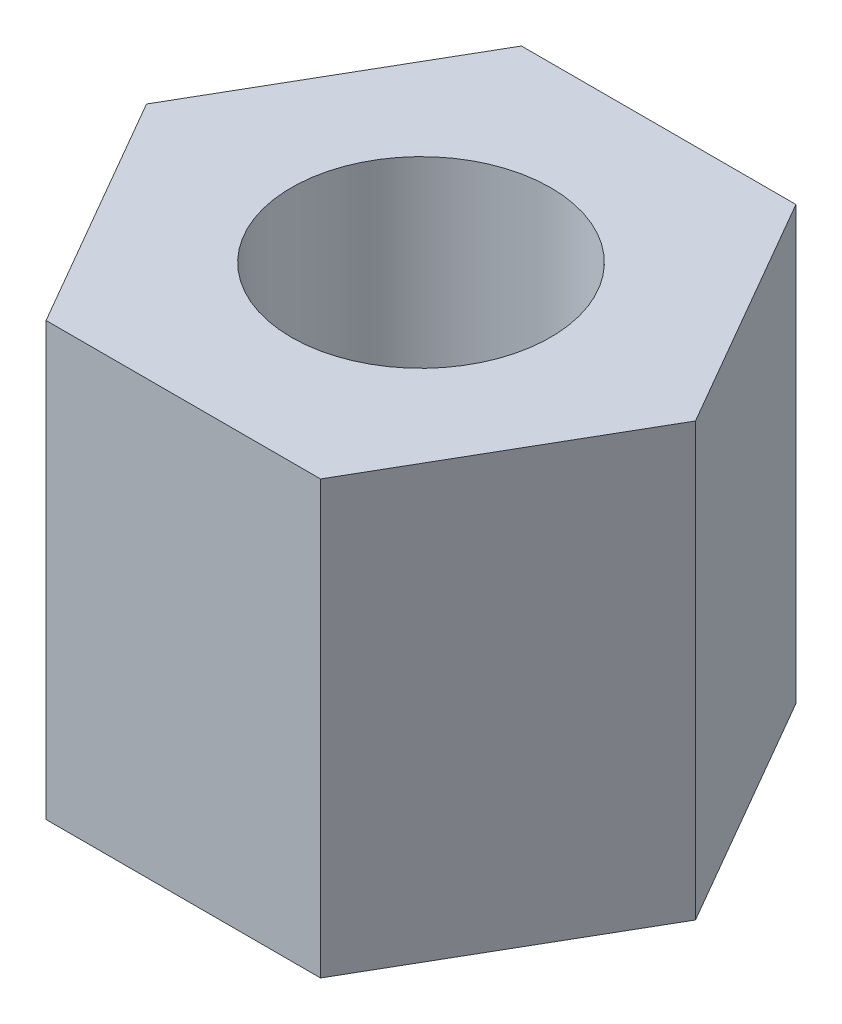
ISO-10303-21;
HEADER;
FILE_DESCRIPTION(('STEP AP214'),'2;1');
FILE_NAME('part.step','',(''),(''),'','','');
FILE_SCHEMA(('AUTOMOTIVE_DESIGN { 1 0 10303 214 1 1 1 1 }'));
ENDSEC;
DATA;
#1=APPLICATION_CONTEXT('core data for automotive mechanical design processes');
#2=APPLICATION_PROTOCOL_DEFINITION('international standard','automotive_design',2000,#1);
#3=PRODUCT_CONTEXT('',#1,'mechanical');
#4=PRODUCT('Part','Part','',(#3));
#5=PRODUCT_RELATED_PRODUCT_CATEGORY('part','',(#4));
#6=PRODUCT_DEFINITION_FORMATION('','',#4);
#7=PRODUCT_DEFINITION_CONTEXT('part definition',#1,'design');
#8=PRODUCT_DEFINITION('design','',#6,#7);
#9=PRODUCT_DEFINITION_SHAPE('','',#8);
#10=(LENGTH_UNIT() NAMED_UNIT(*) SI_UNIT(.MILLI.,.METRE.));
#11=(NAMED_UNIT(*) PLANE_ANGLE_UNIT() SI_UNIT($,.RADIAN.));
#12=(NAMED_UNIT(*) SI_UNIT($,.STERADIAN.) SOLID_ANGLE_UNIT());
#13=UNCERTAINTY_MEASURE_WITH_UNIT(LENGTH_MEASURE(1.E-05),#10,'distance_accuracy_value','');
#14=(GEOMETRIC_REPRESENTATION_CONTEXT(3) GLOBAL_UNCERTAINTY_ASSIGNED_CONTEXT((#13)) GLOBAL_UNIT_ASSIGNED_CONTEXT((#10,
#11,#12)) REPRESENTATION_CONTEXT('',''));
#15=CARTESIAN_POINT('',(0.,0.,0.));
#16=DIRECTION('',(0.,0.,1.));
#17=DIRECTION('',(1.,0.,0.));
#18=AXIS2_PLACEMENT_3D('',#15,#16,#17);
#19=CARTESIAN_POINT('',(0.,5.,0.));
#20=DIRECTION('',(0.,1.,0.));
#21=DIRECTION('',(0.,0.,1.));
#22=AXIS2_PLACEMENT_3D('',#19,#20,#21);
#23=PLANE('',#22);
#24=DIRECTION('',(0.499999999999995,0.,-0.866025403784442));
#25=VECTOR('',#24,1.);
#26=CARTESIAN_POINT('',(1.58771324027149,5.,2.74999999999997));
#27=LINE('',#26,#25);
#28=CARTESIAN_POINT('',(1.58771324027149,5.,2.74999999999997));
#29=VERTEX_POINT('',#28);
#30=CARTESIAN_POINT('',(3.17542648054293,5.,0.));
#31=VERTEX_POINT('',#30);
#32=EDGE_CURVE('E152',#29,#31,#27,.T.);
#33=ORIENTED_EDGE('',*,*,#32,.T.);
#34=DIRECTION('',(-0.500000000000001,0.,-0.866025403784438));
#35=VECTOR('',#34,1.);
#36=CARTESIAN_POINT('',(3.17542648054293,5.,0.));
#37=LINE('',#36,#35);
#38=CARTESIAN_POINT('',(1.58771324027146,5.,-2.74999999999999));
#39=VERTEX_POINT('',#38);
#40=EDGE_CURVE('E100',#31,#39,#37,.T.);
#41=ORIENTED_EDGE('',*,*,#40,.T.);
#42=DIRECTION('',(-1.,0.,0.));
#43=VECTOR('',#42,1.);
#44=CARTESIAN_POINT('',(1.58771324027146,5.,-2.74999999999999));
#45=LINE('',#44,#43);
#46=CARTESIAN_POINT('',(-1.58771324027148,5.,-2.74999999999998));
#47=VERTEX_POINT('',#46);
#48=EDGE_CURVE('E113',#39,#47,#45,.T.);
#49=ORIENTED_EDGE('',*,*,#48,.T.);
#50=DIRECTION('',(-0.499999999999995,0.,0.866025403784442));
#51=VECTOR('',#50,1.);
#52=CARTESIAN_POINT('',(-1.58771324027148,5.,-2.74999999999998));
#53=LINE('',#52,#51);
#54=CARTESIAN_POINT('',(-3.17542648054293,5.,0.));
#55=VERTEX_POINT('',#54);
#56=EDGE_CURVE('E107',#47,#55,#53,.T.);
#57=ORIENTED_EDGE('',*,*,#56,.T.);
#58=DIRECTION('',(0.500000000000007,0.,0.866025403784435));
#59=VECTOR('',#58,1.);
#60=CARTESIAN_POINT('',(-3.17542648054293,5.,0.));
#61=LINE('',#60,#59);
#62=CARTESIAN_POINT('',(-1.58771324027144,5.,2.75));
#63=VERTEX_POINT('',#62);
#64=EDGE_CURVE('E111',#55,#63,#61,.T.);
#65=ORIENTED_EDGE('',*,*,#64,.T.);
#66=DIRECTION('',(1.,0.,0.));
#67=VECTOR('',#66,1.);
#68=CARTESIAN_POINT('',(-1.58771324027144,5.,2.75));
#69=LINE('',#68,#67);
#70=EDGE_CURVE('E63',#63,#29,#69,.T.);
#71=ORIENTED_EDGE('',*,*,#70,.T.);
#72=EDGE_LOOP('',(#33,#41,#49,#57,#65,#71));
#73=FACE_BOUND('',#72,.T.);
#74=CARTESIAN_POINT('',(0.,5.,0.));
#75=DIRECTION('',(0.,1.,0.));
#76=DIRECTION('',(0.,0.,1.));
#77=AXIS2_PLACEMENT_3D('',#74,#75,#76);
#78=CIRCLE('',#77,1.5);
#79=CARTESIAN_POINT('',(0.,5.,1.5));
#80=VERTEX_POINT('',#79);
#81=EDGE_CURVE('E140',#80,#80,#78,.T.);
#82=ORIENTED_EDGE('',*,*,#81,.F.);
#83=EDGE_LOOP('',(#82));
#84=FACE_BOUND('',#83,.T.);
#85=ADVANCED_FACE('F45',(#73,#84),#23,.T.);
#86=CARTESIAN_POINT('',(0.,0.,0.));
#87=DIRECTION('',(0.,1.,0.));
#88=DIRECTION('',(0.,0.,1.));
#89=AXIS2_PLACEMENT_3D('',#86,#87,#88);
#90=PLANE('',#89);
#91=DIRECTION('',(0.499999999999995,0.,-0.866025403784442));
#92=VECTOR('',#91,1.);
#93=CARTESIAN_POINT('',(1.58771324027149,0.,2.74999999999997));
#94=LINE('',#93,#92);
#95=CARTESIAN_POINT('',(1.58771324027149,0.,2.74999999999997));
#96=VERTEX_POINT('',#95);
#97=CARTESIAN_POINT('',(3.17542648054293,0.,0.));
#98=VERTEX_POINT('',#97);
#99=EDGE_CURVE('E135',#96,#98,#94,.T.);
#100=ORIENTED_EDGE('',*,*,#99,.F.);
#101=DIRECTION('',(1.,0.,0.));
#102=VECTOR('',#101,1.);
#103=CARTESIAN_POINT('',(-1.58771324027144,0.,2.75));
#104=LINE('',#103,#102);
#105=CARTESIAN_POINT('',(-1.58771324027144,0.,2.75));
#106=VERTEX_POINT('',#105);
#107=EDGE_CURVE('E92',#106,#96,#104,.T.);
#108=ORIENTED_EDGE('',*,*,#107,.F.);
#109=DIRECTION('',(0.500000000000007,0.,0.866025403784435));
#110=VECTOR('',#109,1.);
#111=CARTESIAN_POINT('',(-3.17542648054293,0.,0.));
#112=LINE('',#111,#110);
#113=CARTESIAN_POINT('',(-3.17542648054293,0.,0.));
#114=VERTEX_POINT('',#113);
#115=EDGE_CURVE('E86',#114,#106,#112,.T.);
#116=ORIENTED_EDGE('',*,*,#115,.F.);
#117=DIRECTION('',(-0.499999999999995,0.,0.866025403784442));
#118=VECTOR('',#117,1.);
#119=CARTESIAN_POINT('',(-1.58771324027148,0.,-2.74999999999998));
#120=LINE('',#119,#118);
#121=CARTESIAN_POINT('',(-1.58771324027148,0.,-2.74999999999998));
#122=VERTEX_POINT('',#121);
#123=EDGE_CURVE('E122',#122,#114,#120,.T.);
#124=ORIENTED_EDGE('',*,*,#123,.F.);
#125=DIRECTION('',(-1.,0.,0.));
#126=VECTOR('',#125,1.);
#127=CARTESIAN_POINT('',(1.58771324027146,0.,-2.74999999999999));
#128=LINE('',#127,#126);
#129=CARTESIAN_POINT('',(1.58771324027146,0.,-2.74999999999999));
#130=VERTEX_POINT('',#129);
#131=EDGE_CURVE('E143',#130,#122,#128,.T.);
#132=ORIENTED_EDGE('',*,*,#131,.F.);
#133=DIRECTION('',(-0.500000000000001,0.,-0.866025403784438));
#134=VECTOR('',#133,1.);
#135=CARTESIAN_POINT('',(3.17542648054293,0.,0.));
#136=LINE('',#135,#134);
#137=EDGE_CURVE('E139',#98,#130,#136,.T.);
#138=ORIENTED_EDGE('',*,*,#137,.F.);
#139=EDGE_LOOP('',(#100,#108,#116,#124,#132,#138));
#140=FACE_BOUND('',#139,.T.);
#141=CARTESIAN_POINT('',(0.,0.,0.));
#142=DIRECTION('',(0.,1.,0.));
#143=DIRECTION('',(0.,0.,1.));
#144=AXIS2_PLACEMENT_3D('',#141,#142,#143);
#145=CIRCLE('',#144,1.5);
#146=CARTESIAN_POINT('',(0.,0.,1.5));
#147=VERTEX_POINT('',#146);
#148=EDGE_CURVE('E249',#147,#147,#145,.T.);
#149=ORIENTED_EDGE('',*,*,#148,.T.);
#150=EDGE_LOOP('',(#149));
#151=FACE_BOUND('',#150,.T.);
#152=ADVANCED_FACE('F165',(#140,#151),#90,.F.);
#153=CARTESIAN_POINT('',(1.58771324027149,5.,2.74999999999997));
#154=DIRECTION('',(-0.866025403784442,0.,-0.499999999999995));
#155=DIRECTION('',(-0.499999999999995,0.,0.866025403784442));
#156=AXIS2_PLACEMENT_3D('',#153,#154,#155);
#157=PLANE('',#156);
#158=ORIENTED_EDGE('',*,*,#99,.T.);
#159=DIRECTION('',(0.,-1.,0.));
#160=VECTOR('',#159,1.);
#161=CARTESIAN_POINT('',(3.17542648054293,5.,0.));
#162=LINE('',#161,#160);
#163=EDGE_CURVE('E11',#31,#98,#162,.T.);
#164=ORIENTED_EDGE('',*,*,#163,.F.);
#165=ORIENTED_EDGE('',*,*,#32,.F.);
#166=DIRECTION('',(0.,-1.,0.));
#167=VECTOR('',#166,1.);
#168=CARTESIAN_POINT('',(1.58771324027149,5.,2.74999999999997));
#169=LINE('',#168,#167);
#170=EDGE_CURVE('E131',#29,#96,#169,.T.);
#171=ORIENTED_EDGE('',*,*,#170,.T.);
#172=EDGE_LOOP('',(#158,#164,#165,#171));
#173=FACE_BOUND('',#172,.T.);
#174=ADVANCED_FACE('F47',(#173),#157,.F.);
#175=CARTESIAN_POINT('',(3.17542648054293,5.,0.));
#176=DIRECTION('',(-0.866025403784438,0.,0.500000000000001));
#177=DIRECTION('',(0.500000000000001,0.,0.866025403784438));
#178=AXIS2_PLACEMENT_3D('',#175,#176,#177);
#179=PLANE('',#178);
#180=ORIENTED_EDGE('',*,*,#137,.T.);
#181=DIRECTION('',(0.,-1.,0.));
#182=VECTOR('',#181,1.);
#183=CARTESIAN_POINT('',(1.58771324027146,5.,-2.74999999999999));
#184=LINE('',#183,#182);
#185=EDGE_CURVE('E55',#39,#130,#184,.T.);
#186=ORIENTED_EDGE('',*,*,#185,.F.);
#187=ORIENTED_EDGE('',*,*,#40,.F.);
#188=ORIENTED_EDGE('',*,*,#163,.T.);
#189=EDGE_LOOP('',(#180,#186,#187,#188));
#190=FACE_BOUND('',#189,.T.);
#191=ADVANCED_FACE('F190',(#190),#179,.F.);
#192=CARTESIAN_POINT('',(1.58771324027146,5.,-2.74999999999999));
#193=DIRECTION('',(0.,0.,1.));
#194=DIRECTION('',(1.,0.,0.));
#195=AXIS2_PLACEMENT_3D('',#192,#193,#194);
#196=PLANE('',#195);
#197=ORIENTED_EDGE('',*,*,#131,.T.);
#198=DIRECTION('',(0.,-1.,0.));
#199=VECTOR('',#198,1.);
#200=CARTESIAN_POINT('',(-1.58771324027148,5.,-2.74999999999998));
#201=LINE('',#200,#199);
#202=EDGE_CURVE('E124',#47,#122,#201,.T.);
#203=ORIENTED_EDGE('',*,*,#202,.F.);
#204=ORIENTED_EDGE('',*,*,#48,.F.);
#205=ORIENTED_EDGE('',*,*,#185,.T.);
#206=EDGE_LOOP('',(#197,#203,#204,#205));
#207=FACE_BOUND('',#206,.T.);
#208=ADVANCED_FACE('F162',(#207),#196,.F.);
#209=CARTESIAN_POINT('',(-1.58771324027148,5.,-2.74999999999998));
#210=DIRECTION('',(0.866025403784442,0.,0.499999999999995));
#211=DIRECTION('',(0.499999999999995,0.,-0.866025403784442));
#212=AXIS2_PLACEMENT_3D('',#209,#210,#211);
#213=PLANE('',#212);
#214=ORIENTED_EDGE('',*,*,#123,.T.);
#215=DIRECTION('',(0.,-1.,0.));
#216=VECTOR('',#215,1.);
#217=CARTESIAN_POINT('',(-3.17542648054293,5.,0.));
#218=LINE('',#217,#216);
#219=EDGE_CURVE('E119',#55,#114,#218,.T.);
#220=ORIENTED_EDGE('',*,*,#219,.F.);
#221=ORIENTED_EDGE('',*,*,#56,.F.);
#222=ORIENTED_EDGE('',*,*,#202,.T.);
#223=EDGE_LOOP('',(#214,#220,#221,#222));
#224=FACE_BOUND('',#223,.T.);
#225=ADVANCED_FACE('F120',(#224),#213,.F.);
#226=CARTESIAN_POINT('',(-3.17542648054293,5.,0.));
#227=DIRECTION('',(0.866025403784435,0.,-0.500000000000007));
#228=DIRECTION('',(-0.500000000000007,0.,-0.866025403784435));
#229=AXIS2_PLACEMENT_3D('',#226,#227,#228);
#230=PLANE('',#229);
#231=ORIENTED_EDGE('',*,*,#115,.T.);
#232=DIRECTION('',(0.,-1.,0.));
#233=VECTOR('',#232,1.);
#234=CARTESIAN_POINT('',(-1.58771324027144,5.,2.75));
#235=LINE('',#234,#233);
#236=EDGE_CURVE('E125',#63,#106,#235,.T.);
#237=ORIENTED_EDGE('',*,*,#236,.F.);
#238=ORIENTED_EDGE('',*,*,#64,.F.);
#239=ORIENTED_EDGE('',*,*,#219,.T.);
#240=EDGE_LOOP('',(#231,#237,#238,#239));
#241=FACE_BOUND('',#240,.T.);
#242=ADVANCED_FACE('F127',(#241),#230,.F.);
#243=CARTESIAN_POINT('',(-1.58771324027144,5.,2.75));
#244=DIRECTION('',(0.,0.,-1.));
#245=DIRECTION('',(-1.,0.,0.));
#246=AXIS2_PLACEMENT_3D('',#243,#244,#245);
#247=PLANE('',#246);
#248=ORIENTED_EDGE('',*,*,#107,.T.);
#249=ORIENTED_EDGE('',*,*,#170,.F.);
#250=ORIENTED_EDGE('',*,*,#70,.F.);
#251=ORIENTED_EDGE('',*,*,#236,.T.);
#252=EDGE_LOOP('',(#248,#249,#250,#251));
#253=FACE_BOUND('',#252,.T.);
#254=ADVANCED_FACE('F170',(#253),#247,.F.);
#255=CARTESIAN_POINT('',(0.,5.,0.));
#256=DIRECTION('',(0.,-1.,0.));
#257=DIRECTION('',(0.,0.,-1.));
#258=AXIS2_PLACEMENT_3D('',#255,#256,#257);
#259=CYLINDRICAL_SURFACE('',#258,1.5);
#260=ORIENTED_EDGE('',*,*,#81,.T.);
#261=EDGE_LOOP('',(#260));
#262=FACE_BOUND('',#261,.T.);
#263=ORIENTED_EDGE('',*,*,#148,.F.);
#264=EDGE_LOOP('',(#263));
#265=FACE_BOUND('',#264,.T.);
#266=ADVANCED_FACE('F172',(#262,#265),#259,.F.);
#267=CLOSED_SHELL('',(#85,#152,#174,#191,#208,#225,#242,#254,#266));
#268=MANIFOLD_SOLID_BREP('B2',#267);
#269=ADVANCED_BREP_SHAPE_REPRESENTATION('',(#18,#268),#14);
#270=SHAPE_DEFINITION_REPRESENTATION(#9,#269);
ENDSEC;
END-ISO-10303-21;
